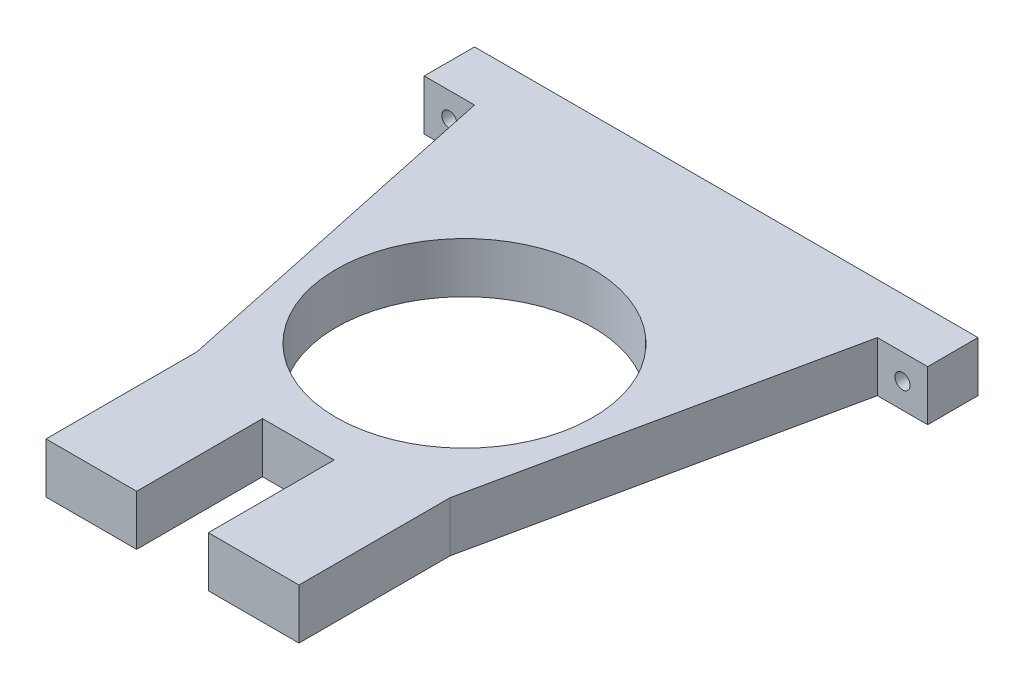
ISO-10303-21;
HEADER;
FILE_DESCRIPTION(('STEP AP214'),'2;1');
FILE_NAME('part.step','',(''),(''),'','','');
FILE_SCHEMA(('AUTOMOTIVE_DESIGN { 1 0 10303 214 1 1 1 1 }'));
ENDSEC;
DATA;
#1=APPLICATION_CONTEXT('core data for automotive mechanical design processes');
#2=APPLICATION_PROTOCOL_DEFINITION('international standard','automotive_design',2000,#1);
#3=PRODUCT_CONTEXT('',#1,'mechanical');
#4=PRODUCT('Part','Part','',(#3));
#5=PRODUCT_RELATED_PRODUCT_CATEGORY('part','',(#4));
#6=PRODUCT_DEFINITION_FORMATION('','',#4);
#7=PRODUCT_DEFINITION_CONTEXT('part definition',#1,'design');
#8=PRODUCT_DEFINITION('design','',#6,#7);
#9=PRODUCT_DEFINITION_SHAPE('','',#8);
#10=(LENGTH_UNIT() NAMED_UNIT(*) SI_UNIT(.MILLI.,.METRE.));
#11=(NAMED_UNIT(*) PLANE_ANGLE_UNIT() SI_UNIT($,.RADIAN.));
#12=(NAMED_UNIT(*) SI_UNIT($,.STERADIAN.) SOLID_ANGLE_UNIT());
#13=UNCERTAINTY_MEASURE_WITH_UNIT(LENGTH_MEASURE(1.E-05),#10,'distance_accuracy_value','');
#14=(GEOMETRIC_REPRESENTATION_CONTEXT(3) GLOBAL_UNCERTAINTY_ASSIGNED_CONTEXT((#13)) GLOBAL_UNIT_ASSIGNED_CONTEXT((#10,
#11,#12)) REPRESENTATION_CONTEXT('',''));
#15=CARTESIAN_POINT('',(0.,0.,0.));
#16=DIRECTION('',(0.,0.,1.));
#17=DIRECTION('',(1.,0.,0.));
#18=AXIS2_PLACEMENT_3D('',#15,#16,#17);
#19=CARTESIAN_POINT('',(0.,10.,9.9999999999999));
#20=DIRECTION('',(0.,0.,-1.));
#21=DIRECTION('',(-1.,0.,0.));
#22=AXIS2_PLACEMENT_3D('',#19,#20,#21);
#23=PLANE('',#22);
#24=CARTESIAN_POINT('',(45.,5.,10.));
#25=DIRECTION('',(0.,0.,1.));
#26=DIRECTION('',(1.,0.,0.));
#27=AXIS2_PLACEMENT_3D('',#24,#25,#26);
#28=CIRCLE('',#27,1.5);
#29=CARTESIAN_POINT('',(46.5,5.,10.));
#30=VERTEX_POINT('',#29);
#31=EDGE_CURVE('E398',#30,#30,#28,.T.);
#32=ORIENTED_EDGE('',*,*,#31,.F.);
#33=EDGE_LOOP('',(#32));
#34=FACE_BOUND('',#33,.T.);
#35=DIRECTION('',(1.,0.,0.));
#36=VECTOR('',#35,1.);
#37=CARTESIAN_POINT('',(0.,0.,9.9999999999999));
#38=LINE('',#37,#36);
#39=CARTESIAN_POINT('',(40.,0.,10.));
#40=VERTEX_POINT('',#39);
#41=CARTESIAN_POINT('',(50.,0.,10.));
#42=VERTEX_POINT('',#41);
#43=EDGE_CURVE('E171',#40,#42,#38,.T.);
#44=ORIENTED_EDGE('',*,*,#43,.T.);
#45=DIRECTION('',(0.,-1.,0.));
#46=VECTOR('',#45,1.);
#47=CARTESIAN_POINT('',(50.,10.,10.));
#48=LINE('',#47,#46);
#49=CARTESIAN_POINT('',(50.,10.,10.));
#50=VERTEX_POINT('',#49);
#51=EDGE_CURVE('E11',#50,#42,#48,.T.);
#52=ORIENTED_EDGE('',*,*,#51,.F.);
#53=DIRECTION('',(1.,0.,0.));
#54=VECTOR('',#53,1.);
#55=CARTESIAN_POINT('',(0.,10.,9.9999999999999));
#56=LINE('',#55,#54);
#57=CARTESIAN_POINT('',(40.,10.,10.));
#58=VERTEX_POINT('',#57);
#59=EDGE_CURVE('E275',#58,#50,#56,.T.);
#60=ORIENTED_EDGE('',*,*,#59,.F.);
#61=DIRECTION('',(0.,-1.,0.));
#62=VECTOR('',#61,1.);
#63=CARTESIAN_POINT('',(40.,10.,10.));
#64=LINE('',#63,#62);
#65=EDGE_CURVE('E164',#58,#40,#64,.T.);
#66=ORIENTED_EDGE('',*,*,#65,.T.);
#67=EDGE_LOOP('',(#44,#52,#60,#66));
#68=FACE_BOUND('',#67,.T.);
#69=ADVANCED_FACE('F35',(#34,#68),#23,.F.);
#70=CARTESIAN_POINT('',(50.,10.,0.));
#71=DIRECTION('',(-1.,0.,0.));
#72=DIRECTION('',(0.,0.,1.));
#73=AXIS2_PLACEMENT_3D('',#70,#71,#72);
#74=PLANE('',#73);
#75=DIRECTION('',(0.,0.,-1.));
#76=VECTOR('',#75,1.);
#77=CARTESIAN_POINT('',(50.,0.,0.));
#78=LINE('',#77,#76);
#79=CARTESIAN_POINT('',(50.,0.,0.));
#80=VERTEX_POINT('',#79);
#81=EDGE_CURVE('E175',#42,#80,#78,.T.);
#82=ORIENTED_EDGE('',*,*,#81,.T.);
#83=DIRECTION('',(0.,-1.,0.));
#84=VECTOR('',#83,1.);
#85=CARTESIAN_POINT('',(50.,10.,0.));
#86=LINE('',#85,#84);
#87=CARTESIAN_POINT('',(50.,10.,0.));
#88=VERTEX_POINT('',#87);
#89=EDGE_CURVE('E44',#88,#80,#86,.T.);
#90=ORIENTED_EDGE('',*,*,#89,.F.);
#91=DIRECTION('',(0.,0.,-1.));
#92=VECTOR('',#91,1.);
#93=CARTESIAN_POINT('',(50.,10.,0.));
#94=LINE('',#93,#92);
#95=EDGE_CURVE('E113',#50,#88,#94,.T.);
#96=ORIENTED_EDGE('',*,*,#95,.F.);
#97=ORIENTED_EDGE('',*,*,#51,.T.);
#98=EDGE_LOOP('',(#82,#90,#96,#97));
#99=FACE_BOUND('',#98,.T.);
#100=ADVANCED_FACE('F289',(#99),#74,.F.);
#101=CARTESIAN_POINT('',(0.,10.,0.));
#102=DIRECTION('',(0.,0.,1.));
#103=DIRECTION('',(1.,0.,0.));
#104=AXIS2_PLACEMENT_3D('',#101,#102,#103);
#105=PLANE('',#104);
#106=CARTESIAN_POINT('',(-45.,4.99999999999999,0.));
#107=DIRECTION('',(0.,0.,1.));
#108=DIRECTION('',(1.,0.,0.));
#109=AXIS2_PLACEMENT_3D('',#106,#107,#108);
#110=CIRCLE('',#109,1.5);
#111=CARTESIAN_POINT('',(-43.5,4.99999999999999,0.));
#112=VERTEX_POINT('',#111);
#113=EDGE_CURVE('E172',#112,#112,#110,.F.);
#114=ORIENTED_EDGE('',*,*,#113,.F.);
#115=EDGE_LOOP('',(#114));
#116=FACE_BOUND('',#115,.T.);
#117=CARTESIAN_POINT('',(45.,5.,0.));
#118=DIRECTION('',(0.,0.,1.));
#119=DIRECTION('',(1.,0.,0.));
#120=AXIS2_PLACEMENT_3D('',#117,#118,#119);
#121=CIRCLE('',#120,1.5);
#122=CARTESIAN_POINT('',(46.5,5.,0.));
#123=VERTEX_POINT('',#122);
#124=EDGE_CURVE('E401',#123,#123,#121,.F.);
#125=ORIENTED_EDGE('',*,*,#124,.F.);
#126=EDGE_LOOP('',(#125));
#127=FACE_BOUND('',#126,.T.);
#128=DIRECTION('',(-1.,0.,0.));
#129=VECTOR('',#128,1.);
#130=CARTESIAN_POINT('',(0.,0.,0.));
#131=LINE('',#130,#129);
#132=CARTESIAN_POINT('',(-50.,0.,0.));
#133=VERTEX_POINT('',#132);
#134=EDGE_CURVE('E177',#80,#133,#131,.T.);
#135=ORIENTED_EDGE('',*,*,#134,.T.);
#136=DIRECTION('',(0.,-1.,0.));
#137=VECTOR('',#136,1.);
#138=CARTESIAN_POINT('',(-50.,10.,0.));
#139=LINE('',#138,#137);
#140=CARTESIAN_POINT('',(-50.,10.,0.));
#141=VERTEX_POINT('',#140);
#142=EDGE_CURVE('E223',#141,#133,#139,.T.);
#143=ORIENTED_EDGE('',*,*,#142,.F.);
#144=DIRECTION('',(-1.,0.,0.));
#145=VECTOR('',#144,1.);
#146=CARTESIAN_POINT('',(0.,10.,0.));
#147=LINE('',#146,#145);
#148=EDGE_CURVE('E231',#88,#141,#147,.T.);
#149=ORIENTED_EDGE('',*,*,#148,.F.);
#150=ORIENTED_EDGE('',*,*,#89,.T.);
#151=EDGE_LOOP('',(#135,#143,#149,#150));
#152=FACE_BOUND('',#151,.T.);
#153=ADVANCED_FACE('F229',(#116,#127,#152),#105,.F.);
#154=CARTESIAN_POINT('',(-50.,10.,0.));
#155=DIRECTION('',(1.,0.,0.));
#156=DIRECTION('',(0.,0.,-1.));
#157=AXIS2_PLACEMENT_3D('',#154,#155,#156);
#158=PLANE('',#157);
#159=DIRECTION('',(0.,0.,1.));
#160=VECTOR('',#159,1.);
#161=CARTESIAN_POINT('',(-50.,0.,0.));
#162=LINE('',#161,#160);
#163=CARTESIAN_POINT('',(-50.,0.,10.));
#164=VERTEX_POINT('',#163);
#165=EDGE_CURVE('E179',#133,#164,#162,.T.);
#166=ORIENTED_EDGE('',*,*,#165,.T.);
#167=DIRECTION('',(0.,-1.,0.));
#168=VECTOR('',#167,1.);
#169=CARTESIAN_POINT('',(-50.,10.,10.));
#170=LINE('',#169,#168);
#171=CARTESIAN_POINT('',(-50.,10.,10.));
#172=VERTEX_POINT('',#171);
#173=EDGE_CURVE('E220',#172,#164,#170,.T.);
#174=ORIENTED_EDGE('',*,*,#173,.F.);
#175=DIRECTION('',(0.,0.,1.));
#176=VECTOR('',#175,1.);
#177=CARTESIAN_POINT('',(-50.,10.,0.));
#178=LINE('',#177,#176);
#179=EDGE_CURVE('E249',#141,#172,#178,.T.);
#180=ORIENTED_EDGE('',*,*,#179,.F.);
#181=ORIENTED_EDGE('',*,*,#142,.T.);
#182=EDGE_LOOP('',(#166,#174,#180,#181));
#183=FACE_BOUND('',#182,.T.);
#184=ADVANCED_FACE('F240',(#183),#158,.F.);
#185=CARTESIAN_POINT('',(0.,10.,10.));
#186=DIRECTION('',(0.,0.,-1.));
#187=DIRECTION('',(-1.,0.,0.));
#188=AXIS2_PLACEMENT_3D('',#185,#186,#187);
#189=PLANE('',#188);
#190=CARTESIAN_POINT('',(-45.,4.99999999999999,10.));
#191=DIRECTION('',(0.,0.,1.));
#192=DIRECTION('',(1.,0.,0.));
#193=AXIS2_PLACEMENT_3D('',#190,#191,#192);
#194=CIRCLE('',#193,1.5);
#195=CARTESIAN_POINT('',(-43.5,4.99999999999999,10.));
#196=VERTEX_POINT('',#195);
#197=EDGE_CURVE('E403',#196,#196,#194,.T.);
#198=ORIENTED_EDGE('',*,*,#197,.F.);
#199=EDGE_LOOP('',(#198));
#200=FACE_BOUND('',#199,.T.);
#201=DIRECTION('',(1.,0.,0.));
#202=VECTOR('',#201,1.);
#203=CARTESIAN_POINT('',(0.,0.,10.));
#204=LINE('',#203,#202);
#205=CARTESIAN_POINT('',(-40.,0.,10.));
#206=VERTEX_POINT('',#205);
#207=EDGE_CURVE('E181',#164,#206,#204,.T.);
#208=ORIENTED_EDGE('',*,*,#207,.T.);
#209=DIRECTION('',(0.,-1.,0.));
#210=VECTOR('',#209,1.);
#211=CARTESIAN_POINT('',(-40.,10.,10.));
#212=LINE('',#211,#210);
#213=CARTESIAN_POINT('',(-40.,10.,10.));
#214=VERTEX_POINT('',#213);
#215=EDGE_CURVE('E217',#214,#206,#212,.T.);
#216=ORIENTED_EDGE('',*,*,#215,.F.);
#217=DIRECTION('',(1.,0.,0.));
#218=VECTOR('',#217,1.);
#219=CARTESIAN_POINT('',(0.,10.,10.));
#220=LINE('',#219,#218);
#221=EDGE_CURVE('E246',#172,#214,#220,.T.);
#222=ORIENTED_EDGE('',*,*,#221,.F.);
#223=ORIENTED_EDGE('',*,*,#173,.T.);
#224=EDGE_LOOP('',(#208,#216,#222,#223));
#225=FACE_BOUND('',#224,.T.);
#226=ADVANCED_FACE('F244',(#200,#225),#189,.F.);
#227=CARTESIAN_POINT('',(-40.3045923682311,10.,8.56700557330288));
#228=DIRECTION('',(0.978147600733806,0.,-0.207911690817756));
#229=DIRECTION('',(-0.207911690817756,0.,-0.978147600733806));
#230=AXIS2_PLACEMENT_3D('',#227,#228,#229);
#231=PLANE('',#230);
#232=DIRECTION('',(0.207911690817756,0.,0.978147600733806));
#233=VECTOR('',#232,1.);
#234=CARTESIAN_POINT('',(-40.3045923682311,0.,8.56700557330288));
#235=LINE('',#234,#233);
#236=CARTESIAN_POINT('',(-25.1210406830987,0.,80.));
#237=VERTEX_POINT('',#236);
#238=EDGE_CURVE('E183',#206,#237,#235,.T.);
#239=ORIENTED_EDGE('',*,*,#238,.T.);
#240=DIRECTION('',(0.,-1.,0.));
#241=VECTOR('',#240,1.);
#242=CARTESIAN_POINT('',(-25.1210406830987,10.,80.));
#243=LINE('',#242,#241);
#244=CARTESIAN_POINT('',(-25.1210406830987,10.,80.));
#245=VERTEX_POINT('',#244);
#246=EDGE_CURVE('E214',#245,#237,#243,.T.);
#247=ORIENTED_EDGE('',*,*,#246,.F.);
#248=DIRECTION('',(0.207911690817756,0.,0.978147600733806));
#249=VECTOR('',#248,1.);
#250=CARTESIAN_POINT('',(-40.3045923682311,10.,8.56700557330288));
#251=LINE('',#250,#249);
#252=EDGE_CURVE('E248',#214,#245,#251,.T.);
#253=ORIENTED_EDGE('',*,*,#252,.F.);
#254=ORIENTED_EDGE('',*,*,#215,.T.);
#255=EDGE_LOOP('',(#239,#247,#253,#254));
#256=FACE_BOUND('',#255,.T.);
#257=ADVANCED_FACE('F304',(#256),#231,.F.);
#258=CARTESIAN_POINT('',(-25.1210406830987,10.,0.));
#259=DIRECTION('',(1.,0.,0.));
#260=DIRECTION('',(0.,0.,-1.));
#261=AXIS2_PLACEMENT_3D('',#258,#259,#260);
#262=PLANE('',#261);
#263=DIRECTION('',(0.,0.,1.));
#264=VECTOR('',#263,1.);
#265=CARTESIAN_POINT('',(-25.1210406830987,0.,0.));
#266=LINE('',#265,#264);
#267=CARTESIAN_POINT('',(-25.1210406830987,0.,110.));
#268=VERTEX_POINT('',#267);
#269=EDGE_CURVE('E185',#237,#268,#266,.T.);
#270=ORIENTED_EDGE('',*,*,#269,.T.);
#271=DIRECTION('',(0.,-1.,0.));
#272=VECTOR('',#271,1.);
#273=CARTESIAN_POINT('',(-25.1210406830987,10.,110.));
#274=LINE('',#273,#272);
#275=CARTESIAN_POINT('',(-25.1210406830987,10.,110.));
#276=VERTEX_POINT('',#275);
#277=EDGE_CURVE('E211',#276,#268,#274,.T.);
#278=ORIENTED_EDGE('',*,*,#277,.F.);
#279=DIRECTION('',(0.,0.,1.));
#280=VECTOR('',#279,1.);
#281=CARTESIAN_POINT('',(-25.1210406830987,10.,0.));
#282=LINE('',#281,#280);
#283=EDGE_CURVE('E251',#245,#276,#282,.T.);
#284=ORIENTED_EDGE('',*,*,#283,.F.);
#285=ORIENTED_EDGE('',*,*,#246,.T.);
#286=EDGE_LOOP('',(#270,#278,#284,#285));
#287=FACE_BOUND('',#286,.T.);
#288=ADVANCED_FACE('F308',(#287),#262,.F.);
#289=CARTESIAN_POINT('',(0.,10.,110.));
#290=DIRECTION('',(0.,0.,-1.));
#291=DIRECTION('',(-1.,0.,0.));
#292=AXIS2_PLACEMENT_3D('',#289,#290,#291);
#293=PLANE('',#292);
#294=DIRECTION('',(1.,0.,0.));
#295=VECTOR('',#294,1.);
#296=CARTESIAN_POINT('',(0.,0.,110.));
#297=LINE('',#296,#295);
#298=CARTESIAN_POINT('',(-7.12104068309867,0.,110.));
#299=VERTEX_POINT('',#298);
#300=EDGE_CURVE('E187',#268,#299,#297,.T.);
#301=ORIENTED_EDGE('',*,*,#300,.T.);
#302=DIRECTION('',(0.,-1.,0.));
#303=VECTOR('',#302,1.);
#304=CARTESIAN_POINT('',(-7.12104068309867,10.,110.));
#305=LINE('',#304,#303);
#306=CARTESIAN_POINT('',(-7.12104068309867,10.,110.));
#307=VERTEX_POINT('',#306);
#308=EDGE_CURVE('E208',#307,#299,#305,.T.);
#309=ORIENTED_EDGE('',*,*,#308,.F.);
#310=DIRECTION('',(1.,0.,0.));
#311=VECTOR('',#310,1.);
#312=CARTESIAN_POINT('',(0.,10.,110.));
#313=LINE('',#312,#311);
#314=EDGE_CURVE('E257',#276,#307,#313,.T.);
#315=ORIENTED_EDGE('',*,*,#314,.F.);
#316=ORIENTED_EDGE('',*,*,#277,.T.);
#317=EDGE_LOOP('',(#301,#309,#315,#316));
#318=FACE_BOUND('',#317,.T.);
#319=ADVANCED_FACE('F312',(#318),#293,.F.);
#320=CARTESIAN_POINT('',(-7.12104068309867,10.,0.));
#321=DIRECTION('',(-1.,0.,0.));
#322=DIRECTION('',(0.,0.,1.));
#323=AXIS2_PLACEMENT_3D('',#320,#321,#322);
#324=PLANE('',#323);
#325=DIRECTION('',(0.,0.,-1.));
#326=VECTOR('',#325,1.);
#327=CARTESIAN_POINT('',(-7.12104068309867,0.,0.));
#328=LINE('',#327,#326);
#329=CARTESIAN_POINT('',(-7.12104068309867,0.,85.));
#330=VERTEX_POINT('',#329);
#331=EDGE_CURVE('E189',#299,#330,#328,.T.);
#332=ORIENTED_EDGE('',*,*,#331,.T.);
#333=DIRECTION('',(0.,-1.,0.));
#334=VECTOR('',#333,1.);
#335=CARTESIAN_POINT('',(-7.12104068309867,10.,85.));
#336=LINE('',#335,#334);
#337=CARTESIAN_POINT('',(-7.12104068309867,10.,85.));
#338=VERTEX_POINT('',#337);
#339=EDGE_CURVE('E205',#338,#330,#336,.T.);
#340=ORIENTED_EDGE('',*,*,#339,.F.);
#341=DIRECTION('',(0.,0.,-1.));
#342=VECTOR('',#341,1.);
#343=CARTESIAN_POINT('',(-7.12104068309867,10.,0.));
#344=LINE('',#343,#342);
#345=EDGE_CURVE('E259',#307,#338,#344,.T.);
#346=ORIENTED_EDGE('',*,*,#345,.F.);
#347=ORIENTED_EDGE('',*,*,#308,.T.);
#348=EDGE_LOOP('',(#332,#340,#346,#347));
#349=FACE_BOUND('',#348,.T.);
#350=ADVANCED_FACE('F316',(#349),#324,.F.);
#351=CARTESIAN_POINT('',(0.,10.,85.));
#352=DIRECTION('',(0.,0.,-1.));
#353=DIRECTION('',(-1.,0.,0.));
#354=AXIS2_PLACEMENT_3D('',#351,#352,#353);
#355=PLANE('',#354);
#356=DIRECTION('',(1.,0.,0.));
#357=VECTOR('',#356,1.);
#358=CARTESIAN_POINT('',(0.,0.,85.));
#359=LINE('',#358,#357);
#360=CARTESIAN_POINT('',(7.12104068309869,0.,85.));
#361=VERTEX_POINT('',#360);
#362=EDGE_CURVE('E191',#330,#361,#359,.T.);
#363=ORIENTED_EDGE('',*,*,#362,.T.);
#364=DIRECTION('',(0.,-1.,0.));
#365=VECTOR('',#364,1.);
#366=CARTESIAN_POINT('',(7.12104068309869,10.,85.));
#367=LINE('',#366,#365);
#368=CARTESIAN_POINT('',(7.12104068309869,10.,85.));
#369=VERTEX_POINT('',#368);
#370=EDGE_CURVE('E202',#369,#361,#367,.T.);
#371=ORIENTED_EDGE('',*,*,#370,.F.);
#372=DIRECTION('',(1.,0.,0.));
#373=VECTOR('',#372,1.);
#374=CARTESIAN_POINT('',(0.,10.,85.));
#375=LINE('',#374,#373);
#376=EDGE_CURVE('E261',#338,#369,#375,.T.);
#377=ORIENTED_EDGE('',*,*,#376,.F.);
#378=ORIENTED_EDGE('',*,*,#339,.T.);
#379=EDGE_LOOP('',(#363,#371,#377,#378));
#380=FACE_BOUND('',#379,.T.);
#381=ADVANCED_FACE('F267',(#380),#355,.F.);
#382=CARTESIAN_POINT('',(7.12104068309859,10.,0.));
#383=DIRECTION('',(1.,0.,0.));
#384=DIRECTION('',(0.,0.,-1.));
#385=AXIS2_PLACEMENT_3D('',#382,#383,#384);
#386=PLANE('',#385);
#387=DIRECTION('',(0.,0.,1.));
#388=VECTOR('',#387,1.);
#389=CARTESIAN_POINT('',(7.12104068309859,0.,0.));
#390=LINE('',#389,#388);
#391=CARTESIAN_POINT('',(7.12104068309872,0.,110.));
#392=VERTEX_POINT('',#391);
#393=EDGE_CURVE('E193',#361,#392,#390,.T.);
#394=ORIENTED_EDGE('',*,*,#393,.T.);
#395=DIRECTION('',(0.,-1.,0.));
#396=VECTOR('',#395,1.);
#397=CARTESIAN_POINT('',(7.12104068309872,10.,110.));
#398=LINE('',#397,#396);
#399=CARTESIAN_POINT('',(7.12104068309872,10.,110.));
#400=VERTEX_POINT('',#399);
#401=EDGE_CURVE('E159',#400,#392,#398,.T.);
#402=ORIENTED_EDGE('',*,*,#401,.F.);
#403=DIRECTION('',(0.,0.,1.));
#404=VECTOR('',#403,1.);
#405=CARTESIAN_POINT('',(7.12104068309859,10.,0.));
#406=LINE('',#405,#404);
#407=EDGE_CURVE('E150',#369,#400,#406,.T.);
#408=ORIENTED_EDGE('',*,*,#407,.F.);
#409=ORIENTED_EDGE('',*,*,#370,.T.);
#410=EDGE_LOOP('',(#394,#402,#408,#409));
#411=FACE_BOUND('',#410,.T.);
#412=ADVANCED_FACE('F271',(#411),#386,.F.);
#413=CARTESIAN_POINT('',(0.,10.,110.));
#414=DIRECTION('',(0.,0.,-1.));
#415=DIRECTION('',(-1.,0.,0.));
#416=AXIS2_PLACEMENT_3D('',#413,#414,#415);
#417=PLANE('',#416);
#418=DIRECTION('',(1.,0.,0.));
#419=VECTOR('',#418,1.);
#420=CARTESIAN_POINT('',(0.,0.,110.));
#421=LINE('',#420,#419);
#422=CARTESIAN_POINT('',(25.1210406830987,0.,110.));
#423=VERTEX_POINT('',#422);
#424=EDGE_CURVE('E158',#392,#423,#421,.T.);
#425=ORIENTED_EDGE('',*,*,#424,.T.);
#426=DIRECTION('',(0.,-1.,0.));
#427=VECTOR('',#426,1.);
#428=CARTESIAN_POINT('',(25.1210406830987,10.,110.));
#429=LINE('',#428,#427);
#430=CARTESIAN_POINT('',(25.1210406830987,10.,110.));
#431=VERTEX_POINT('',#430);
#432=EDGE_CURVE('E155',#431,#423,#429,.T.);
#433=ORIENTED_EDGE('',*,*,#432,.F.);
#434=DIRECTION('',(1.,0.,0.));
#435=VECTOR('',#434,1.);
#436=CARTESIAN_POINT('',(0.,10.,110.));
#437=LINE('',#436,#435);
#438=EDGE_CURVE('E144',#400,#431,#437,.T.);
#439=ORIENTED_EDGE('',*,*,#438,.F.);
#440=ORIENTED_EDGE('',*,*,#401,.T.);
#441=EDGE_LOOP('',(#425,#433,#439,#440));
#442=FACE_BOUND('',#441,.T.);
#443=ADVANCED_FACE('F156',(#442),#417,.F.);
#444=CARTESIAN_POINT('',(25.1210406830987,10.,0.));
#445=DIRECTION('',(-1.,0.,0.));
#446=DIRECTION('',(0.,0.,1.));
#447=AXIS2_PLACEMENT_3D('',#444,#445,#446);
#448=PLANE('',#447);
#449=DIRECTION('',(0.,0.,-1.));
#450=VECTOR('',#449,1.);
#451=CARTESIAN_POINT('',(25.1210406830987,0.,0.));
#452=LINE('',#451,#450);
#453=CARTESIAN_POINT('',(25.1210406830987,0.,80.));
#454=VERTEX_POINT('',#453);
#455=EDGE_CURVE('E99',#423,#454,#452,.T.);
#456=ORIENTED_EDGE('',*,*,#455,.T.);
#457=DIRECTION('',(0.,-1.,0.));
#458=VECTOR('',#457,1.);
#459=CARTESIAN_POINT('',(25.1210406830987,10.,80.));
#460=LINE('',#459,#458);
#461=CARTESIAN_POINT('',(25.1210406830987,10.,80.));
#462=VERTEX_POINT('',#461);
#463=EDGE_CURVE('E160',#462,#454,#460,.T.);
#464=ORIENTED_EDGE('',*,*,#463,.F.);
#465=DIRECTION('',(0.,0.,-1.));
#466=VECTOR('',#465,1.);
#467=CARTESIAN_POINT('',(25.1210406830987,10.,0.));
#468=LINE('',#467,#466);
#469=EDGE_CURVE('E148',#431,#462,#468,.T.);
#470=ORIENTED_EDGE('',*,*,#469,.F.);
#471=ORIENTED_EDGE('',*,*,#432,.T.);
#472=EDGE_LOOP('',(#456,#464,#470,#471));
#473=FACE_BOUND('',#472,.T.);
#474=ADVANCED_FACE('F162',(#473),#448,.F.);
#475=CARTESIAN_POINT('',(0.,10.,52.));
#476=DIRECTION('',(0.,-1.,0.));
#477=DIRECTION('',(0.,0.,-1.));
#478=AXIS2_PLACEMENT_3D('',#475,#476,#477);
#479=CYLINDRICAL_SURFACE('',#478,25.5);
#480=CARTESIAN_POINT('',(0.,10.,52.));
#481=DIRECTION('',(0.,1.,0.));
#482=DIRECTION('',(0.,0.,1.));
#483=AXIS2_PLACEMENT_3D('',#480,#481,#482);
#484=CIRCLE('',#483,25.5);
#485=CARTESIAN_POINT('',(0.,10.,77.5));
#486=VERTEX_POINT('',#485);
#487=EDGE_CURVE('E198',#486,#486,#484,.T.);
#488=ORIENTED_EDGE('',*,*,#487,.T.);
#489=EDGE_LOOP('',(#488));
#490=FACE_BOUND('',#489,.T.);
#491=CARTESIAN_POINT('',(0.,0.,52.));
#492=DIRECTION('',(0.,1.,0.));
#493=DIRECTION('',(0.,0.,1.));
#494=AXIS2_PLACEMENT_3D('',#491,#492,#493);
#495=CIRCLE('',#494,25.5);
#496=CARTESIAN_POINT('',(0.,0.,77.5));
#497=VERTEX_POINT('',#496);
#498=EDGE_CURVE('E168',#497,#497,#495,.T.);
#499=ORIENTED_EDGE('',*,*,#498,.F.);
#500=EDGE_LOOP('',(#499));
#501=FACE_BOUND('',#500,.T.);
#502=ADVANCED_FACE('F37',(#490,#501),#479,.F.);
#503=CARTESIAN_POINT('',(40.304592368231,10.,8.56700557330286));
#504=DIRECTION('',(-0.978147600733806,0.,-0.207911690817756));
#505=DIRECTION('',(-0.207911690817756,0.,0.978147600733806));
#506=AXIS2_PLACEMENT_3D('',#503,#504,#505);
#507=PLANE('',#506);
#508=DIRECTION('',(0.207911690817756,0.,-0.978147600733806));
#509=VECTOR('',#508,1.);
#510=CARTESIAN_POINT('',(40.304592368231,0.,8.56700557330286));
#511=LINE('',#510,#509);
#512=EDGE_CURVE('E105',#454,#40,#511,.T.);
#513=ORIENTED_EDGE('',*,*,#512,.T.);
#514=ORIENTED_EDGE('',*,*,#65,.F.);
#515=DIRECTION('',(0.207911690817756,0.,-0.978147600733806));
#516=VECTOR('',#515,1.);
#517=CARTESIAN_POINT('',(40.304592368231,10.,8.56700557330286));
#518=LINE('',#517,#516);
#519=EDGE_CURVE('E52',#462,#58,#518,.T.);
#520=ORIENTED_EDGE('',*,*,#519,.F.);
#521=ORIENTED_EDGE('',*,*,#463,.T.);
#522=EDGE_LOOP('',(#513,#514,#520,#521));
#523=FACE_BOUND('',#522,.T.);
#524=ADVANCED_FACE('F276',(#523),#507,.F.);
#525=CARTESIAN_POINT('',(0.,10.,0.));
#526=DIRECTION('',(0.,1.,0.));
#527=DIRECTION('',(0.,0.,1.));
#528=AXIS2_PLACEMENT_3D('',#525,#526,#527);
#529=PLANE('',#528);
#530=ORIENTED_EDGE('',*,*,#487,.F.);
#531=EDGE_LOOP('',(#530));
#532=FACE_BOUND('',#531,.T.);
#533=ORIENTED_EDGE('',*,*,#59,.T.);
#534=ORIENTED_EDGE('',*,*,#95,.T.);
#535=ORIENTED_EDGE('',*,*,#148,.T.);
#536=ORIENTED_EDGE('',*,*,#179,.T.);
#537=ORIENTED_EDGE('',*,*,#221,.T.);
#538=ORIENTED_EDGE('',*,*,#252,.T.);
#539=ORIENTED_EDGE('',*,*,#283,.T.);
#540=ORIENTED_EDGE('',*,*,#314,.T.);
#541=ORIENTED_EDGE('',*,*,#345,.T.);
#542=ORIENTED_EDGE('',*,*,#376,.T.);
#543=ORIENTED_EDGE('',*,*,#407,.T.);
#544=ORIENTED_EDGE('',*,*,#438,.T.);
#545=ORIENTED_EDGE('',*,*,#469,.T.);
#546=ORIENTED_EDGE('',*,*,#519,.T.);
#547=EDGE_LOOP('',(#533,#534,#535,#536,#537,#538,#539,#540,#541,#542,#543,#544,#545,#546));
#548=FACE_BOUND('',#547,.T.);
#549=ADVANCED_FACE('F146',(#532,#548),#529,.T.);
#550=CARTESIAN_POINT('',(0.,0.,0.));
#551=DIRECTION('',(0.,1.,0.));
#552=DIRECTION('',(0.,0.,1.));
#553=AXIS2_PLACEMENT_3D('',#550,#551,#552);
#554=PLANE('',#553);
#555=ORIENTED_EDGE('',*,*,#498,.T.);
#556=EDGE_LOOP('',(#555));
#557=FACE_BOUND('',#556,.T.);
#558=ORIENTED_EDGE('',*,*,#43,.F.);
#559=ORIENTED_EDGE('',*,*,#512,.F.);
#560=ORIENTED_EDGE('',*,*,#455,.F.);
#561=ORIENTED_EDGE('',*,*,#424,.F.);
#562=ORIENTED_EDGE('',*,*,#393,.F.);
#563=ORIENTED_EDGE('',*,*,#362,.F.);
#564=ORIENTED_EDGE('',*,*,#331,.F.);
#565=ORIENTED_EDGE('',*,*,#300,.F.);
#566=ORIENTED_EDGE('',*,*,#269,.F.);
#567=ORIENTED_EDGE('',*,*,#238,.F.);
#568=ORIENTED_EDGE('',*,*,#207,.F.);
#569=ORIENTED_EDGE('',*,*,#165,.F.);
#570=ORIENTED_EDGE('',*,*,#134,.F.);
#571=ORIENTED_EDGE('',*,*,#81,.F.);
#572=EDGE_LOOP('',(#558,#559,#560,#561,#562,#563,#564,#565,#566,#567,#568,#569,#570,#571));
#573=FACE_BOUND('',#572,.T.);
#574=ADVANCED_FACE('F235',(#557,#573),#554,.F.);
#575=CARTESIAN_POINT('',(-45.,4.99999999999999,-0.000999999999999265));
#576=DIRECTION('',(0.,0.,1.));
#577=DIRECTION('',(1.,0.,0.));
#578=AXIS2_PLACEMENT_3D('',#575,#576,#577);
#579=CYLINDRICAL_SURFACE('',#578,1.5);
#580=ORIENTED_EDGE('',*,*,#197,.T.);
#581=EDGE_LOOP('',(#580));
#582=FACE_BOUND('',#581,.T.);
#583=ORIENTED_EDGE('',*,*,#113,.T.);
#584=EDGE_LOOP('',(#583));
#585=FACE_BOUND('',#584,.T.);
#586=ADVANCED_FACE('F353',(#582,#585),#579,.F.);
#587=CARTESIAN_POINT('',(45.,5.,-0.000999999999999265));
#588=DIRECTION('',(0.,0.,1.));
#589=DIRECTION('',(1.,0.,0.));
#590=AXIS2_PLACEMENT_3D('',#587,#588,#589);
#591=CYLINDRICAL_SURFACE('',#590,1.5);
#592=ORIENTED_EDGE('',*,*,#31,.T.);
#593=EDGE_LOOP('',(#592));
#594=FACE_BOUND('',#593,.T.);
#595=ORIENTED_EDGE('',*,*,#124,.T.);
#596=EDGE_LOOP('',(#595));
#597=FACE_BOUND('',#596,.T.);
#598=ADVANCED_FACE('F382',(#594,#597),#591,.F.);
#599=CLOSED_SHELL('',(#69,#100,#153,#184,#226,#257,#288,#319,#350,#381,#412,#443,#474,#502,#524,
#549,#574,#586,#598));
#600=MANIFOLD_SOLID_BREP('B2',#599);
#601=ADVANCED_BREP_SHAPE_REPRESENTATION('',(#18,#600),#14);
#602=SHAPE_DEFINITION_REPRESENTATION(#9,#601);
ENDSEC;
END-ISO-10303-21;
